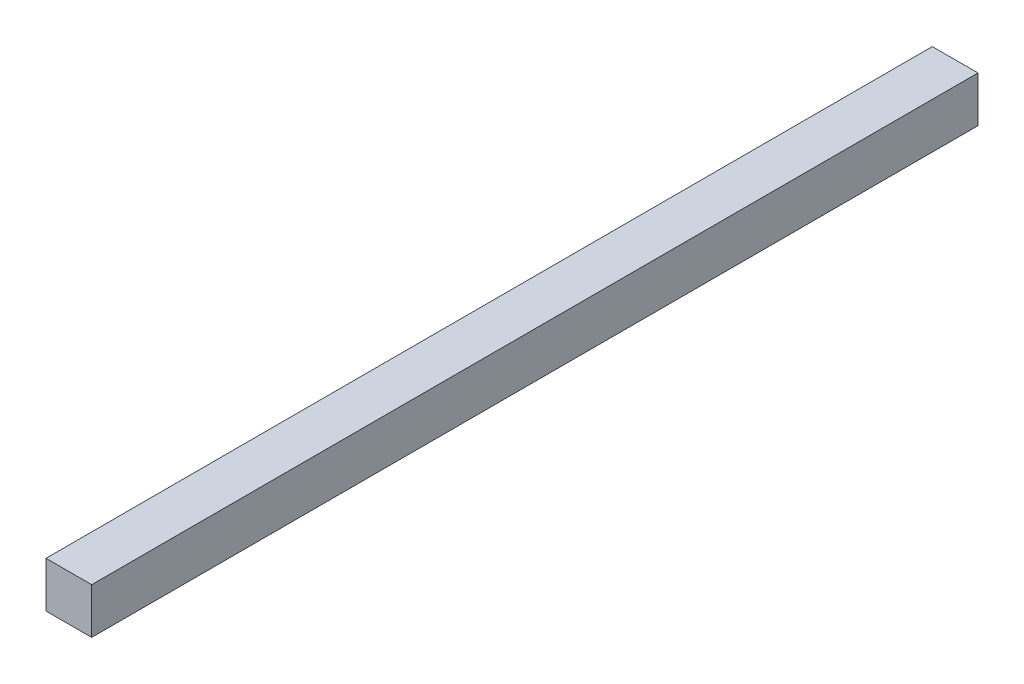
ISO-10303-21;
HEADER;
FILE_DESCRIPTION(('STEP AP214'),'2;1');
FILE_NAME('part.step','',(''),(''),'','','');
FILE_SCHEMA(('AUTOMOTIVE_DESIGN { 1 0 10303 214 1 1 1 1 }'));
ENDSEC;
DATA;
#1=APPLICATION_CONTEXT('core data for automotive mechanical design processes');
#2=APPLICATION_PROTOCOL_DEFINITION('international standard','automotive_design',2000,#1);
#3=PRODUCT_CONTEXT('',#1,'mechanical');
#4=PRODUCT('Part','Part','',(#3));
#5=PRODUCT_RELATED_PRODUCT_CATEGORY('part','',(#4));
#6=PRODUCT_DEFINITION_FORMATION('','',#4);
#7=PRODUCT_DEFINITION_CONTEXT('part definition',#1,'design');
#8=PRODUCT_DEFINITION('design','',#6,#7);
#9=PRODUCT_DEFINITION_SHAPE('','',#8);
#10=(LENGTH_UNIT() NAMED_UNIT(*) SI_UNIT(.MILLI.,.METRE.));
#11=(NAMED_UNIT(*) PLANE_ANGLE_UNIT() SI_UNIT($,.RADIAN.));
#12=(NAMED_UNIT(*) SI_UNIT($,.STERADIAN.) SOLID_ANGLE_UNIT());
#13=UNCERTAINTY_MEASURE_WITH_UNIT(LENGTH_MEASURE(1.E-05),#10,'distance_accuracy_value','');
#14=(GEOMETRIC_REPRESENTATION_CONTEXT(3) GLOBAL_UNCERTAINTY_ASSIGNED_CONTEXT((#13)) GLOBAL_UNIT_ASSIGNED_CONTEXT((#10,
#11,#12)) REPRESENTATION_CONTEXT('',''));
#15=CARTESIAN_POINT('',(0.,0.,0.));
#16=DIRECTION('',(0.,0.,1.));
#17=DIRECTION('',(1.,0.,0.));
#18=AXIS2_PLACEMENT_3D('',#15,#16,#17);
#19=CARTESIAN_POINT('',(-5.,5.,194.));
#20=DIRECTION('',(1.,0.,0.));
#21=DIRECTION('',(0.,1.,0.));
#22=AXIS2_PLACEMENT_3D('',#19,#20,#21);
#23=PLANE('',#22);
#24=DIRECTION('',(0.,-1.,0.));
#25=VECTOR('',#24,1.);
#26=CARTESIAN_POINT('',(-5.,5.,0.));
#27=LINE('',#26,#25);
#28=CARTESIAN_POINT('',(-5.,5.,0.));
#29=VERTEX_POINT('',#28);
#30=CARTESIAN_POINT('',(-5.,-5.,0.));
#31=VERTEX_POINT('',#30);
#32=EDGE_CURVE('E95',#29,#31,#27,.T.);
#33=ORIENTED_EDGE('',*,*,#32,.T.);
#34=DIRECTION('',(0.,0.,-1.));
#35=VECTOR('',#34,1.);
#36=CARTESIAN_POINT('',(-5.,-5.,194.));
#37=LINE('',#36,#35);
#38=CARTESIAN_POINT('',(-5.,-5.,194.));
#39=VERTEX_POINT('',#38);
#40=EDGE_CURVE('E11',#39,#31,#37,.T.);
#41=ORIENTED_EDGE('',*,*,#40,.F.);
#42=DIRECTION('',(0.,-1.,0.));
#43=VECTOR('',#42,1.);
#44=CARTESIAN_POINT('',(-5.,5.,194.));
#45=LINE('',#44,#43);
#46=CARTESIAN_POINT('',(-5.,5.,194.));
#47=VERTEX_POINT('',#46);
#48=EDGE_CURVE('E83',#47,#39,#45,.T.);
#49=ORIENTED_EDGE('',*,*,#48,.F.);
#50=DIRECTION('',(0.,0.,-1.));
#51=VECTOR('',#50,1.);
#52=CARTESIAN_POINT('',(-5.,5.,194.));
#53=LINE('',#52,#51);
#54=EDGE_CURVE('E91',#47,#29,#53,.T.);
#55=ORIENTED_EDGE('',*,*,#54,.T.);
#56=EDGE_LOOP('',(#33,#41,#49,#55));
#57=FACE_BOUND('',#56,.T.);
#58=ADVANCED_FACE('F32',(#57),#23,.F.);
#59=CARTESIAN_POINT('',(5.,-5.,194.));
#60=DIRECTION('',(0.,1.,0.));
#61=DIRECTION('',(-1.,0.,0.));
#62=AXIS2_PLACEMENT_3D('',#59,#60,#61);
#63=PLANE('',#62);
#64=DIRECTION('',(1.,0.,0.));
#65=VECTOR('',#64,1.);
#66=CARTESIAN_POINT('',(5.,-5.,0.));
#67=LINE('',#66,#65);
#68=CARTESIAN_POINT('',(5.,-5.,0.));
#69=VERTEX_POINT('',#68);
#70=EDGE_CURVE('E87',#31,#69,#67,.T.);
#71=ORIENTED_EDGE('',*,*,#70,.T.);
#72=DIRECTION('',(0.,0.,-1.));
#73=VECTOR('',#72,1.);
#74=CARTESIAN_POINT('',(5.,-5.,194.));
#75=LINE('',#74,#73);
#76=CARTESIAN_POINT('',(5.,-5.,194.));
#77=VERTEX_POINT('',#76);
#78=EDGE_CURVE('E40',#77,#69,#75,.T.);
#79=ORIENTED_EDGE('',*,*,#78,.F.);
#80=DIRECTION('',(1.,0.,0.));
#81=VECTOR('',#80,1.);
#82=CARTESIAN_POINT('',(5.,-5.,194.));
#83=LINE('',#82,#81);
#84=EDGE_CURVE('E78',#39,#77,#83,.T.);
#85=ORIENTED_EDGE('',*,*,#84,.F.);
#86=ORIENTED_EDGE('',*,*,#40,.T.);
#87=EDGE_LOOP('',(#71,#79,#85,#86));
#88=FACE_BOUND('',#87,.T.);
#89=ADVANCED_FACE('F86',(#88),#63,.F.);
#90=CARTESIAN_POINT('',(5.,5.,194.));
#91=DIRECTION('',(-1.,0.,0.));
#92=DIRECTION('',(0.,-1.,0.));
#93=AXIS2_PLACEMENT_3D('',#90,#91,#92);
#94=PLANE('',#93);
#95=DIRECTION('',(0.,1.,0.));
#96=VECTOR('',#95,1.);
#97=CARTESIAN_POINT('',(5.,5.,0.));
#98=LINE('',#97,#96);
#99=CARTESIAN_POINT('',(5.,5.,0.));
#100=VERTEX_POINT('',#99);
#101=EDGE_CURVE('E65',#69,#100,#98,.T.);
#102=ORIENTED_EDGE('',*,*,#101,.T.);
#103=DIRECTION('',(0.,0.,-1.));
#104=VECTOR('',#103,1.);
#105=CARTESIAN_POINT('',(5.,5.,194.));
#106=LINE('',#105,#104);
#107=CARTESIAN_POINT('',(5.,5.,194.));
#108=VERTEX_POINT('',#107);
#109=EDGE_CURVE('E88',#108,#100,#106,.T.);
#110=ORIENTED_EDGE('',*,*,#109,.F.);
#111=DIRECTION('',(0.,1.,0.));
#112=VECTOR('',#111,1.);
#113=CARTESIAN_POINT('',(5.,5.,194.));
#114=LINE('',#113,#112);
#115=EDGE_CURVE('E81',#77,#108,#114,.T.);
#116=ORIENTED_EDGE('',*,*,#115,.F.);
#117=ORIENTED_EDGE('',*,*,#78,.T.);
#118=EDGE_LOOP('',(#102,#110,#116,#117));
#119=FACE_BOUND('',#118,.T.);
#120=ADVANCED_FACE('F89',(#119),#94,.F.);
#121=CARTESIAN_POINT('',(5.,5.,194.));
#122=DIRECTION('',(0.,-1.,0.));
#123=DIRECTION('',(1.,0.,0.));
#124=AXIS2_PLACEMENT_3D('',#121,#122,#123);
#125=PLANE('',#124);
#126=DIRECTION('',(-1.,0.,0.));
#127=VECTOR('',#126,1.);
#128=CARTESIAN_POINT('',(5.,5.,0.));
#129=LINE('',#128,#127);
#130=EDGE_CURVE('E71',#100,#29,#129,.T.);
#131=ORIENTED_EDGE('',*,*,#130,.T.);
#132=ORIENTED_EDGE('',*,*,#54,.F.);
#133=DIRECTION('',(-1.,0.,0.));
#134=VECTOR('',#133,1.);
#135=CARTESIAN_POINT('',(5.,5.,194.));
#136=LINE('',#135,#134);
#137=EDGE_CURVE('E48',#108,#47,#136,.T.);
#138=ORIENTED_EDGE('',*,*,#137,.F.);
#139=ORIENTED_EDGE('',*,*,#109,.T.);
#140=EDGE_LOOP('',(#131,#132,#138,#139));
#141=FACE_BOUND('',#140,.T.);
#142=ADVANCED_FACE('F102',(#141),#125,.F.);
#143=CARTESIAN_POINT('',(0.,0.,194.));
#144=DIRECTION('',(0.,0.,-1.));
#145=DIRECTION('',(-1.,0.,0.));
#146=AXIS2_PLACEMENT_3D('',#143,#144,#145);
#147=PLANE('',#146);
#148=ORIENTED_EDGE('',*,*,#48,.T.);
#149=ORIENTED_EDGE('',*,*,#84,.T.);
#150=ORIENTED_EDGE('',*,*,#115,.T.);
#151=ORIENTED_EDGE('',*,*,#137,.T.);
#152=EDGE_LOOP('',(#148,#149,#150,#151));
#153=FACE_BOUND('',#152,.T.);
#154=ADVANCED_FACE('F79',(#153),#147,.F.);
#155=CARTESIAN_POINT('',(0.,0.,0.));
#156=DIRECTION('',(0.,0.,-1.));
#157=DIRECTION('',(-1.,0.,0.));
#158=AXIS2_PLACEMENT_3D('',#155,#156,#157);
#159=PLANE('',#158);
#160=ORIENTED_EDGE('',*,*,#32,.F.);
#161=ORIENTED_EDGE('',*,*,#130,.F.);
#162=ORIENTED_EDGE('',*,*,#101,.F.);
#163=ORIENTED_EDGE('',*,*,#70,.F.);
#164=EDGE_LOOP('',(#160,#161,#162,#163));
#165=FACE_BOUND('',#164,.T.);
#166=ADVANCED_FACE('F105',(#165),#159,.T.);
#167=CLOSED_SHELL('',(#58,#89,#120,#142,#154,#166));
#168=MANIFOLD_SOLID_BREP('B2',#167);
#169=ADVANCED_BREP_SHAPE_REPRESENTATION('',(#18,#168),#14);
#170=SHAPE_DEFINITION_REPRESENTATION(#9,#169);
ENDSEC;
END-ISO-10303-21;
